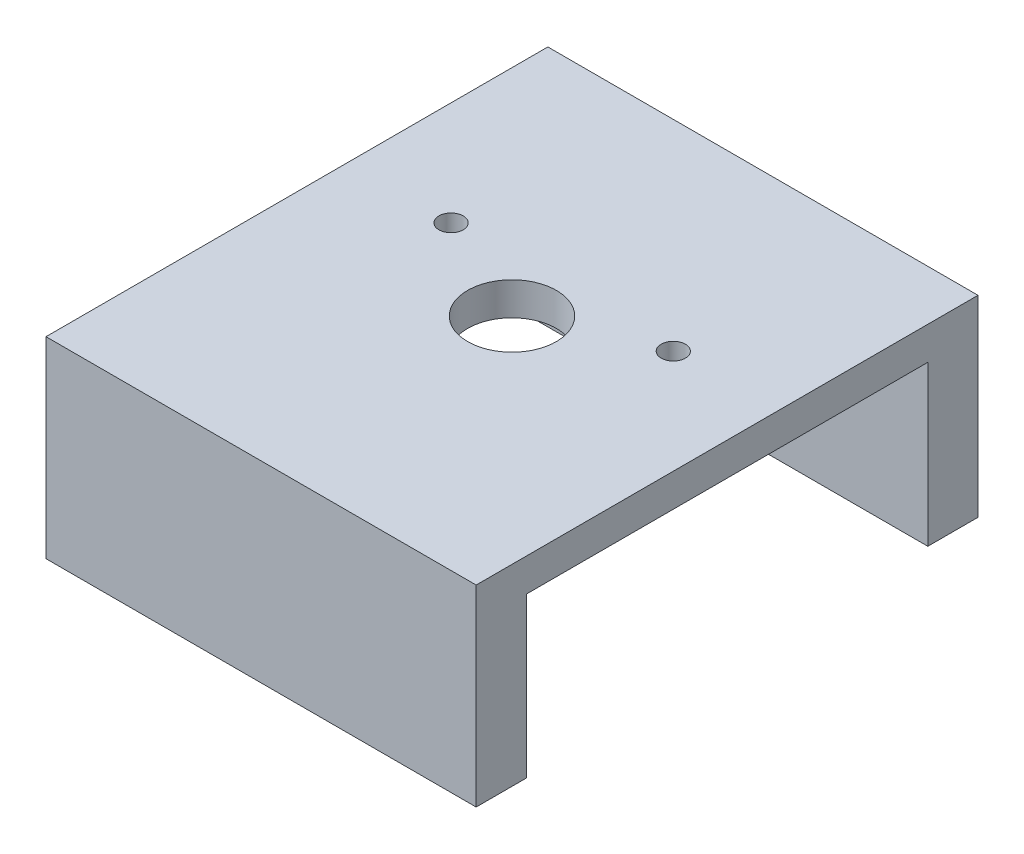
ISO-10303-21;
HEADER;
FILE_DESCRIPTION(('STEP AP214'),'2;1');
FILE_NAME('part.step','',(''),(''),'','','');
FILE_SCHEMA(('AUTOMOTIVE_DESIGN { 1 0 10303 214 1 1 1 1 }'));
ENDSEC;
DATA;
#1=APPLICATION_CONTEXT('core data for automotive mechanical design processes');
#2=APPLICATION_PROTOCOL_DEFINITION('international standard','automotive_design',2000,#1);
#3=PRODUCT_CONTEXT('',#1,'mechanical');
#4=PRODUCT('Part','Part','',(#3));
#5=PRODUCT_RELATED_PRODUCT_CATEGORY('part','',(#4));
#6=PRODUCT_DEFINITION_FORMATION('','',#4);
#7=PRODUCT_DEFINITION_CONTEXT('part definition',#1,'design');
#8=PRODUCT_DEFINITION('design','',#6,#7);
#9=PRODUCT_DEFINITION_SHAPE('','',#8);
#10=(LENGTH_UNIT() NAMED_UNIT(*) SI_UNIT(.MILLI.,.METRE.));
#11=(NAMED_UNIT(*) PLANE_ANGLE_UNIT() SI_UNIT($,.RADIAN.));
#12=(NAMED_UNIT(*) SI_UNIT($,.STERADIAN.) SOLID_ANGLE_UNIT());
#13=UNCERTAINTY_MEASURE_WITH_UNIT(LENGTH_MEASURE(1.E-05),#10,'distance_accuracy_value','');
#14=(GEOMETRIC_REPRESENTATION_CONTEXT(3) GLOBAL_UNCERTAINTY_ASSIGNED_CONTEXT((#13)) GLOBAL_UNIT_ASSIGNED_CONTEXT((#10,
#11,#12)) REPRESENTATION_CONTEXT('',''));
#15=CARTESIAN_POINT('',(0.,0.,0.));
#16=DIRECTION('',(0.,0.,1.));
#17=DIRECTION('',(1.,0.,0.));
#18=AXIS2_PLACEMENT_3D('',#15,#16,#17);
#19=CARTESIAN_POINT('',(0.,0.,0.));
#20=DIRECTION('',(0.,-1.,0.));
#21=DIRECTION('',(0.,0.,-1.));
#22=AXIS2_PLACEMENT_3D('',#19,#20,#21);
#23=PLANE('',#22);
#24=DIRECTION('',(1.,0.,0.));
#25=VECTOR('',#24,1.);
#26=CARTESIAN_POINT('',(60.,0.,-7.));
#27=LINE('',#26,#25);
#28=CARTESIAN_POINT('',(0.,0.,-7.));
#29=VERTEX_POINT('',#28);
#30=CARTESIAN_POINT('',(60.,0.,-7.));
#31=VERTEX_POINT('',#30);
#32=EDGE_CURVE('E137',#29,#31,#27,.T.);
#33=ORIENTED_EDGE('',*,*,#32,.F.);
#34=DIRECTION('',(0.,0.,1.));
#35=VECTOR('',#34,1.);
#36=CARTESIAN_POINT('',(0.,0.,0.));
#37=LINE('',#36,#35);
#38=CARTESIAN_POINT('',(0.,0.,-63.));
#39=VERTEX_POINT('',#38);
#40=EDGE_CURVE('E178',#39,#29,#37,.T.);
#41=ORIENTED_EDGE('',*,*,#40,.F.);
#42=DIRECTION('',(1.,0.,0.));
#43=VECTOR('',#42,1.);
#44=CARTESIAN_POINT('',(60.,0.,-63.));
#45=LINE('',#44,#43);
#46=CARTESIAN_POINT('',(60.,0.,-63.));
#47=VERTEX_POINT('',#46);
#48=EDGE_CURVE('E173',#39,#47,#45,.T.);
#49=ORIENTED_EDGE('',*,*,#48,.T.);
#50=DIRECTION('',(0.,0.,-1.));
#51=VECTOR('',#50,1.);
#52=CARTESIAN_POINT('',(60.,0.,0.));
#53=LINE('',#52,#51);
#54=EDGE_CURVE('E41',#31,#47,#53,.T.);
#55=ORIENTED_EDGE('',*,*,#54,.F.);
#56=EDGE_LOOP('',(#33,#41,#49,#55));
#57=FACE_BOUND('',#56,.T.);
#58=CARTESIAN_POINT('',(30.,0.,-35.));
#59=DIRECTION('',(0.,1.,0.));
#60=DIRECTION('',(0.,0.,1.));
#61=AXIS2_PLACEMENT_3D('',#58,#59,#60);
#62=CIRCLE('',#61,6.19050000000001);
#63=CARTESIAN_POINT('',(30.,0.,-28.8095));
#64=VERTEX_POINT('',#63);
#65=EDGE_CURVE('E198',#64,#64,#62,.T.);
#66=ORIENTED_EDGE('',*,*,#65,.T.);
#67=EDGE_LOOP('',(#66));
#68=FACE_BOUND('',#67,.T.);
#69=CARTESIAN_POINT('',(45.5,0.,-42.));
#70=DIRECTION('',(0.,1.,0.));
#71=DIRECTION('',(0.,0.,1.));
#72=AXIS2_PLACEMENT_3D('',#69,#70,#71);
#73=CIRCLE('',#72,1.6905);
#74=CARTESIAN_POINT('',(45.5,0.,-40.3095));
#75=VERTEX_POINT('',#74);
#76=EDGE_CURVE('E205',#75,#75,#73,.T.);
#77=ORIENTED_EDGE('',*,*,#76,.T.);
#78=EDGE_LOOP('',(#77));
#79=FACE_BOUND('',#78,.T.);
#80=CARTESIAN_POINT('',(14.5,0.,-42.));
#81=DIRECTION('',(0.,1.,0.));
#82=DIRECTION('',(0.,0.,1.));
#83=AXIS2_PLACEMENT_3D('',#80,#81,#82);
#84=CIRCLE('',#83,1.6905);
#85=CARTESIAN_POINT('',(14.5,0.,-40.3095));
#86=VERTEX_POINT('',#85);
#87=EDGE_CURVE('E252',#86,#86,#84,.T.);
#88=ORIENTED_EDGE('',*,*,#87,.T.);
#89=EDGE_LOOP('',(#88));
#90=FACE_BOUND('',#89,.T.);
#91=ADVANCED_FACE('F37',(#57,#68,#79,#90),#23,.T.);
#92=CARTESIAN_POINT('',(0.,4.5974,0.));
#93=DIRECTION('',(1.,0.,0.));
#94=DIRECTION('',(0.,0.,-1.));
#95=AXIS2_PLACEMENT_3D('',#92,#93,#94);
#96=PLANE('',#95);
#97=DIRECTION('',(0.,-1.,0.));
#98=VECTOR('',#97,1.);
#99=CARTESIAN_POINT('',(0.,4.5974,-70.));
#100=LINE('',#99,#98);
#101=CARTESIAN_POINT('',(0.,4.5974,-70.));
#102=VERTEX_POINT('',#101);
#103=CARTESIAN_POINT('',(0.,-22.225,-70.));
#104=VERTEX_POINT('',#103);
#105=EDGE_CURVE('E218',#102,#104,#100,.T.);
#106=ORIENTED_EDGE('',*,*,#105,.T.);
#107=DIRECTION('',(0.,0.,-1.));
#108=VECTOR('',#107,1.);
#109=CARTESIAN_POINT('',(0.,-22.225,-63.));
#110=LINE('',#109,#108);
#111=CARTESIAN_POINT('',(0.,-22.225,-63.));
#112=VERTEX_POINT('',#111);
#113=EDGE_CURVE('E191',#112,#104,#110,.T.);
#114=ORIENTED_EDGE('',*,*,#113,.F.);
#115=DIRECTION('',(0.,1.,0.));
#116=VECTOR('',#115,1.);
#117=CARTESIAN_POINT('',(0.,0.,-63.));
#118=LINE('',#117,#116);
#119=EDGE_CURVE('E167',#112,#39,#118,.T.);
#120=ORIENTED_EDGE('',*,*,#119,.T.);
#121=ORIENTED_EDGE('',*,*,#40,.T.);
#122=DIRECTION('',(0.,1.,0.));
#123=VECTOR('',#122,1.);
#124=CARTESIAN_POINT('',(0.,0.,-7.));
#125=LINE('',#124,#123);
#126=CARTESIAN_POINT('',(0.,-22.225,-7.));
#127=VERTEX_POINT('',#126);
#128=EDGE_CURVE('E139',#127,#29,#125,.T.);
#129=ORIENTED_EDGE('',*,*,#128,.F.);
#130=DIRECTION('',(0.,0.,1.));
#131=VECTOR('',#130,1.);
#132=CARTESIAN_POINT('',(0.,-22.225,-7.));
#133=LINE('',#132,#131);
#134=CARTESIAN_POINT('',(0.,-22.225,0.));
#135=VERTEX_POINT('',#134);
#136=EDGE_CURVE('E143',#127,#135,#133,.T.);
#137=ORIENTED_EDGE('',*,*,#136,.T.);
#138=DIRECTION('',(0.,-1.,0.));
#139=VECTOR('',#138,1.);
#140=CARTESIAN_POINT('',(0.,4.5974,0.));
#141=LINE('',#140,#139);
#142=CARTESIAN_POINT('',(0.,4.5974,0.));
#143=VERTEX_POINT('',#142);
#144=EDGE_CURVE('E11',#143,#135,#141,.T.);
#145=ORIENTED_EDGE('',*,*,#144,.F.);
#146=DIRECTION('',(0.,0.,1.));
#147=VECTOR('',#146,1.);
#148=CARTESIAN_POINT('',(0.,4.5974,0.));
#149=LINE('',#148,#147);
#150=EDGE_CURVE('E199',#102,#143,#149,.T.);
#151=ORIENTED_EDGE('',*,*,#150,.F.);
#152=EDGE_LOOP('',(#106,#114,#120,#121,#129,#137,#145,#151));
#153=FACE_BOUND('',#152,.T.);
#154=ADVANCED_FACE('F39',(#153),#96,.F.);
#155=CARTESIAN_POINT('',(0.,4.5974,0.));
#156=DIRECTION('',(0.,0.,-1.));
#157=DIRECTION('',(-1.,0.,0.));
#158=AXIS2_PLACEMENT_3D('',#155,#156,#157);
#159=PLANE('',#158);
#160=ORIENTED_EDGE('',*,*,#144,.T.);
#161=DIRECTION('',(-1.,0.,0.));
#162=VECTOR('',#161,1.);
#163=CARTESIAN_POINT('',(0.,-22.225,0.));
#164=LINE('',#163,#162);
#165=CARTESIAN_POINT('',(60.,-22.225,0.));
#166=VERTEX_POINT('',#165);
#167=EDGE_CURVE('E135',#166,#135,#164,.T.);
#168=ORIENTED_EDGE('',*,*,#167,.F.);
#169=DIRECTION('',(0.,-1.,0.));
#170=VECTOR('',#169,1.);
#171=CARTESIAN_POINT('',(60.,4.5974,0.));
#172=LINE('',#171,#170);
#173=CARTESIAN_POINT('',(60.,4.5974,0.));
#174=VERTEX_POINT('',#173);
#175=EDGE_CURVE('E47',#174,#166,#172,.T.);
#176=ORIENTED_EDGE('',*,*,#175,.F.);
#177=DIRECTION('',(1.,0.,0.));
#178=VECTOR('',#177,1.);
#179=CARTESIAN_POINT('',(0.,4.5974,0.));
#180=LINE('',#179,#178);
#181=EDGE_CURVE('E213',#143,#174,#180,.T.);
#182=ORIENTED_EDGE('',*,*,#181,.F.);
#183=EDGE_LOOP('',(#160,#168,#176,#182));
#184=FACE_BOUND('',#183,.T.);
#185=ADVANCED_FACE('F231',(#184),#159,.F.);
#186=CARTESIAN_POINT('',(60.,4.5974,0.));
#187=DIRECTION('',(-1.,0.,0.));
#188=DIRECTION('',(0.,0.,1.));
#189=AXIS2_PLACEMENT_3D('',#186,#187,#188);
#190=PLANE('',#189);
#191=ORIENTED_EDGE('',*,*,#175,.T.);
#192=DIRECTION('',(0.,0.,1.));
#193=VECTOR('',#192,1.);
#194=CARTESIAN_POINT('',(60.,-22.225,-7.));
#195=LINE('',#194,#193);
#196=CARTESIAN_POINT('',(60.,-22.225,-7.));
#197=VERTEX_POINT('',#196);
#198=EDGE_CURVE('E146',#197,#166,#195,.T.);
#199=ORIENTED_EDGE('',*,*,#198,.F.);
#200=DIRECTION('',(0.,-1.,0.));
#201=VECTOR('',#200,1.);
#202=CARTESIAN_POINT('',(60.,-22.225,-7.));
#203=LINE('',#202,#201);
#204=EDGE_CURVE('E55',#31,#197,#203,.T.);
#205=ORIENTED_EDGE('',*,*,#204,.F.);
#206=ORIENTED_EDGE('',*,*,#54,.T.);
#207=DIRECTION('',(0.,-1.,0.));
#208=VECTOR('',#207,1.);
#209=CARTESIAN_POINT('',(60.,-22.225,-63.));
#210=LINE('',#209,#208);
#211=CARTESIAN_POINT('',(60.,-22.225,-63.));
#212=VERTEX_POINT('',#211);
#213=EDGE_CURVE('E168',#47,#212,#210,.T.);
#214=ORIENTED_EDGE('',*,*,#213,.T.);
#215=DIRECTION('',(0.,0.,-1.));
#216=VECTOR('',#215,1.);
#217=CARTESIAN_POINT('',(60.,-22.225,-63.));
#218=LINE('',#217,#216);
#219=CARTESIAN_POINT('',(60.,-22.225,-70.));
#220=VERTEX_POINT('',#219);
#221=EDGE_CURVE('E177',#212,#220,#218,.T.);
#222=ORIENTED_EDGE('',*,*,#221,.T.);
#223=DIRECTION('',(0.,-1.,0.));
#224=VECTOR('',#223,1.);
#225=CARTESIAN_POINT('',(60.,4.5974,-70.));
#226=LINE('',#225,#224);
#227=CARTESIAN_POINT('',(60.,4.5974,-70.));
#228=VERTEX_POINT('',#227);
#229=EDGE_CURVE('E223',#228,#220,#226,.T.);
#230=ORIENTED_EDGE('',*,*,#229,.F.);
#231=DIRECTION('',(0.,0.,-1.));
#232=VECTOR('',#231,1.);
#233=CARTESIAN_POINT('',(60.,4.5974,0.));
#234=LINE('',#233,#232);
#235=EDGE_CURVE('E215',#174,#228,#234,.T.);
#236=ORIENTED_EDGE('',*,*,#235,.F.);
#237=EDGE_LOOP('',(#191,#199,#205,#206,#214,#222,#230,#236));
#238=FACE_BOUND('',#237,.T.);
#239=ADVANCED_FACE('F228',(#238),#190,.F.);
#240=CARTESIAN_POINT('',(0.,4.5974,-70.));
#241=DIRECTION('',(0.,0.,1.));
#242=DIRECTION('',(1.,0.,0.));
#243=AXIS2_PLACEMENT_3D('',#240,#241,#242);
#244=PLANE('',#243);
#245=ORIENTED_EDGE('',*,*,#229,.T.);
#246=DIRECTION('',(-1.,0.,0.));
#247=VECTOR('',#246,1.);
#248=CARTESIAN_POINT('',(0.,-22.225,-70.));
#249=LINE('',#248,#247);
#250=EDGE_CURVE('E163',#220,#104,#249,.T.);
#251=ORIENTED_EDGE('',*,*,#250,.T.);
#252=ORIENTED_EDGE('',*,*,#105,.F.);
#253=DIRECTION('',(-1.,0.,0.));
#254=VECTOR('',#253,1.);
#255=CARTESIAN_POINT('',(0.,4.5974,-70.));
#256=LINE('',#255,#254);
#257=EDGE_CURVE('E217',#228,#102,#256,.T.);
#258=ORIENTED_EDGE('',*,*,#257,.F.);
#259=EDGE_LOOP('',(#245,#251,#252,#258));
#260=FACE_BOUND('',#259,.T.);
#261=ADVANCED_FACE('F245',(#260),#244,.F.);
#262=CARTESIAN_POINT('',(0.,4.5974,0.));
#263=DIRECTION('',(0.,-1.,0.));
#264=DIRECTION('',(0.,0.,-1.));
#265=AXIS2_PLACEMENT_3D('',#262,#263,#264);
#266=PLANE('',#265);
#267=CARTESIAN_POINT('',(14.5,4.5974,-42.));
#268=DIRECTION('',(0.,1.,0.));
#269=DIRECTION('',(0.,0.,1.));
#270=AXIS2_PLACEMENT_3D('',#267,#268,#269);
#271=CIRCLE('',#270,1.6905);
#272=CARTESIAN_POINT('',(14.5,4.5974,-40.3095));
#273=VERTEX_POINT('',#272);
#274=EDGE_CURVE('E250',#273,#273,#271,.T.);
#275=ORIENTED_EDGE('',*,*,#274,.F.);
#276=EDGE_LOOP('',(#275));
#277=FACE_BOUND('',#276,.T.);
#278=CARTESIAN_POINT('',(45.5,4.5974,-42.));
#279=DIRECTION('',(0.,1.,0.));
#280=DIRECTION('',(0.,0.,1.));
#281=AXIS2_PLACEMENT_3D('',#278,#279,#280);
#282=CIRCLE('',#281,1.6905);
#283=CARTESIAN_POINT('',(45.5,4.5974,-40.3095));
#284=VERTEX_POINT('',#283);
#285=EDGE_CURVE('E208',#284,#284,#282,.T.);
#286=ORIENTED_EDGE('',*,*,#285,.F.);
#287=EDGE_LOOP('',(#286));
#288=FACE_BOUND('',#287,.T.);
#289=CARTESIAN_POINT('',(30.,4.5974,-35.));
#290=DIRECTION('',(0.,1.,0.));
#291=DIRECTION('',(0.,0.,1.));
#292=AXIS2_PLACEMENT_3D('',#289,#290,#291);
#293=CIRCLE('',#292,6.19050000000001);
#294=CARTESIAN_POINT('',(30.,4.5974,-28.8095));
#295=VERTEX_POINT('',#294);
#296=EDGE_CURVE('E201',#295,#295,#293,.T.);
#297=ORIENTED_EDGE('',*,*,#296,.F.);
#298=EDGE_LOOP('',(#297));
#299=FACE_BOUND('',#298,.T.);
#300=ORIENTED_EDGE('',*,*,#150,.T.);
#301=ORIENTED_EDGE('',*,*,#181,.T.);
#302=ORIENTED_EDGE('',*,*,#235,.T.);
#303=ORIENTED_EDGE('',*,*,#257,.T.);
#304=EDGE_LOOP('',(#300,#301,#302,#303));
#305=FACE_BOUND('',#304,.T.);
#306=ADVANCED_FACE('F241',(#277,#288,#299,#305),#266,.F.);
#307=CARTESIAN_POINT('',(30.,0.,-35.));
#308=DIRECTION('',(0.,1.,0.));
#309=DIRECTION('',(0.,0.,1.));
#310=AXIS2_PLACEMENT_3D('',#307,#308,#309);
#311=CYLINDRICAL_SURFACE('',#310,6.19050000000001);
#312=ORIENTED_EDGE('',*,*,#65,.F.);
#313=EDGE_LOOP('',(#312));
#314=FACE_BOUND('',#313,.T.);
#315=ORIENTED_EDGE('',*,*,#296,.T.);
#316=EDGE_LOOP('',(#315));
#317=FACE_BOUND('',#316,.T.);
#318=ADVANCED_FACE('F267',(#314,#317),#311,.F.);
#319=CARTESIAN_POINT('',(45.5,0.,-42.));
#320=DIRECTION('',(0.,1.,0.));
#321=DIRECTION('',(0.,0.,1.));
#322=AXIS2_PLACEMENT_3D('',#319,#320,#321);
#323=CYLINDRICAL_SURFACE('',#322,1.6905);
#324=ORIENTED_EDGE('',*,*,#76,.F.);
#325=EDGE_LOOP('',(#324));
#326=FACE_BOUND('',#325,.T.);
#327=ORIENTED_EDGE('',*,*,#285,.T.);
#328=EDGE_LOOP('',(#327));
#329=FACE_BOUND('',#328,.T.);
#330=ADVANCED_FACE('F263',(#326,#329),#323,.F.);
#331=CARTESIAN_POINT('',(14.5,0.,-42.));
#332=DIRECTION('',(0.,1.,0.));
#333=DIRECTION('',(0.,0.,1.));
#334=AXIS2_PLACEMENT_3D('',#331,#332,#333);
#335=CYLINDRICAL_SURFACE('',#334,1.6905);
#336=ORIENTED_EDGE('',*,*,#87,.F.);
#337=EDGE_LOOP('',(#336));
#338=FACE_BOUND('',#337,.T.);
#339=ORIENTED_EDGE('',*,*,#274,.T.);
#340=EDGE_LOOP('',(#339));
#341=FACE_BOUND('',#340,.T.);
#342=ADVANCED_FACE('F278',(#338,#341),#335,.F.);
#343=CARTESIAN_POINT('',(0.,-22.225,-63.));
#344=DIRECTION('',(0.,-1.,0.));
#345=DIRECTION('',(0.,0.,-1.));
#346=AXIS2_PLACEMENT_3D('',#343,#344,#345);
#347=PLANE('',#346);
#348=CARTESIAN_POINT('',(6.35104386015332,-22.225,-66.3681092284144));
#349=DIRECTION('',(0.,-1.,0.));
#350=DIRECTION('',(0.,0.,-1.));
#351=AXIS2_PLACEMENT_3D('',#348,#349,#350);
#352=CIRCLE('',#351,1.35254999999999);
#353=CARTESIAN_POINT('',(6.35104386015332,-22.225,-67.7206592284144));
#354=VERTEX_POINT('',#353);
#355=EDGE_CURVE('E149',#354,#354,#352,.T.);
#356=ORIENTED_EDGE('',*,*,#355,.F.);
#357=EDGE_LOOP('',(#356));
#358=FACE_BOUND('',#357,.T.);
#359=CARTESIAN_POINT('',(53.65,-22.225,-66.3249191923123));
#360=DIRECTION('',(0.,-1.,0.));
#361=DIRECTION('',(0.,0.,-1.));
#362=AXIS2_PLACEMENT_3D('',#359,#360,#361);
#363=CIRCLE('',#362,1.35254999999999);
#364=CARTESIAN_POINT('',(53.65,-22.225,-67.6774691923123));
#365=VERTEX_POINT('',#364);
#366=EDGE_CURVE('E157',#365,#365,#363,.T.);
#367=ORIENTED_EDGE('',*,*,#366,.F.);
#368=EDGE_LOOP('',(#367));
#369=FACE_BOUND('',#368,.T.);
#370=ORIENTED_EDGE('',*,*,#250,.F.);
#371=ORIENTED_EDGE('',*,*,#221,.F.);
#372=DIRECTION('',(-1.,0.,0.));
#373=VECTOR('',#372,1.);
#374=CARTESIAN_POINT('',(0.,-22.225,-63.));
#375=LINE('',#374,#373);
#376=EDGE_CURVE('E164',#212,#112,#375,.T.);
#377=ORIENTED_EDGE('',*,*,#376,.T.);
#378=ORIENTED_EDGE('',*,*,#113,.T.);
#379=EDGE_LOOP('',(#370,#371,#377,#378));
#380=FACE_BOUND('',#379,.T.);
#381=ADVANCED_FACE('F249',(#358,#369,#380),#347,.T.);
#382=CARTESIAN_POINT('',(0.,0.,-63.));
#383=DIRECTION('',(0.,0.,1.));
#384=DIRECTION('',(1.,0.,0.));
#385=AXIS2_PLACEMENT_3D('',#382,#383,#384);
#386=PLANE('',#385);
#387=ORIENTED_EDGE('',*,*,#213,.F.);
#388=ORIENTED_EDGE('',*,*,#48,.F.);
#389=ORIENTED_EDGE('',*,*,#119,.F.);
#390=ORIENTED_EDGE('',*,*,#376,.F.);
#391=EDGE_LOOP('',(#387,#388,#389,#390));
#392=FACE_BOUND('',#391,.T.);
#393=ADVANCED_FACE('F194',(#392),#386,.T.);
#394=CARTESIAN_POINT('',(53.65,3.17499999999999,-66.3249191923123));
#395=DIRECTION('',(0.,-1.,0.));
#396=DIRECTION('',(0.,0.,-1.));
#397=AXIS2_PLACEMENT_3D('',#394,#395,#396);
#398=CONICAL_SURFACE('',#397,1.35254999999999,1.02974425867665);
#399=CARTESIAN_POINT('',(53.65,3.98769403026572,-66.3249191923123));
#400=VERTEX_POINT('',#399);
#401=VERTEX_LOOP('',#400);
#402=FACE_BOUND('',#401,.T.);
#403=CARTESIAN_POINT('',(53.65,3.17499999999999,-66.3249191923123));
#404=DIRECTION('',(0.,-1.,0.));
#405=DIRECTION('',(0.,0.,-1.));
#406=AXIS2_PLACEMENT_3D('',#403,#404,#405);
#407=CIRCLE('',#406,1.35254999999999);
#408=CARTESIAN_POINT('',(53.65,3.17499999999999,-67.6774691923123));
#409=VERTEX_POINT('',#408);
#410=EDGE_CURVE('E160',#409,#409,#407,.T.);
#411=ORIENTED_EDGE('',*,*,#410,.T.);
#412=EDGE_LOOP('',(#411));
#413=FACE_BOUND('',#412,.T.);
#414=ADVANCED_FACE('F345',(#402,#413),#398,.F.);
#415=CARTESIAN_POINT('',(53.65,-22.225,-66.3249191923123));
#416=DIRECTION('',(0.,-1.,0.));
#417=DIRECTION('',(0.,0.,-1.));
#418=AXIS2_PLACEMENT_3D('',#415,#416,#417);
#419=CYLINDRICAL_SURFACE('',#418,1.35254999999999);
#420=ORIENTED_EDGE('',*,*,#410,.F.);
#421=EDGE_LOOP('',(#420));
#422=FACE_BOUND('',#421,.T.);
#423=ORIENTED_EDGE('',*,*,#366,.T.);
#424=EDGE_LOOP('',(#423));
#425=FACE_BOUND('',#424,.T.);
#426=ADVANCED_FACE('F351',(#422,#425),#419,.F.);
#427=CARTESIAN_POINT('',(6.35104386015332,3.175,-66.3681092284144));
#428=DIRECTION('',(0.,-1.,0.));
#429=DIRECTION('',(0.,0.,-1.));
#430=AXIS2_PLACEMENT_3D('',#427,#428,#429);
#431=CONICAL_SURFACE('',#430,1.35255,1.02974425867665);
#432=CARTESIAN_POINT('',(6.35104386015332,3.98769403026573,-66.3681092284144));
#433=VERTEX_POINT('',#432);
#434=VERTEX_LOOP('',#433);
#435=FACE_BOUND('',#434,.T.);
#436=CARTESIAN_POINT('',(6.35104386015332,3.175,-66.3681092284144));
#437=DIRECTION('',(0.,-1.,0.));
#438=DIRECTION('',(0.,0.,-1.));
#439=AXIS2_PLACEMENT_3D('',#436,#437,#438);
#440=CIRCLE('',#439,1.35255);
#441=CARTESIAN_POINT('',(6.35104386015332,3.175,-67.7206592284144));
#442=VERTEX_POINT('',#441);
#443=EDGE_CURVE('E154',#442,#442,#440,.T.);
#444=ORIENTED_EDGE('',*,*,#443,.T.);
#445=EDGE_LOOP('',(#444));
#446=FACE_BOUND('',#445,.T.);
#447=ADVANCED_FACE('F359',(#435,#446),#431,.F.);
#448=CARTESIAN_POINT('',(6.35104386015332,-22.225,-66.3681092284144));
#449=DIRECTION('',(0.,-1.,0.));
#450=DIRECTION('',(0.,0.,-1.));
#451=AXIS2_PLACEMENT_3D('',#448,#449,#450);
#452=CYLINDRICAL_SURFACE('',#451,1.35254999999999);
#453=ORIENTED_EDGE('',*,*,#443,.F.);
#454=EDGE_LOOP('',(#453));
#455=FACE_BOUND('',#454,.T.);
#456=ORIENTED_EDGE('',*,*,#355,.T.);
#457=EDGE_LOOP('',(#456));
#458=FACE_BOUND('',#457,.T.);
#459=ADVANCED_FACE('F367',(#455,#458),#452,.F.);
#460=CARTESIAN_POINT('',(0.,-22.225,-7.));
#461=DIRECTION('',(0.,1.,0.));
#462=DIRECTION('',(0.,0.,1.));
#463=AXIS2_PLACEMENT_3D('',#460,#461,#462);
#464=PLANE('',#463);
#465=CARTESIAN_POINT('',(6.35104386015332,-22.225,-3.63189077158563));
#466=DIRECTION('',(0.,-1.,0.));
#467=DIRECTION('',(0.,0.,-1.));
#468=AXIS2_PLACEMENT_3D('',#465,#466,#467);
#469=CIRCLE('',#468,1.35254999999999);
#470=CARTESIAN_POINT('',(6.35104386015332,-22.225,-4.98444077158562));
#471=VERTEX_POINT('',#470);
#472=EDGE_CURVE('E125',#471,#471,#469,.T.);
#473=ORIENTED_EDGE('',*,*,#472,.F.);
#474=EDGE_LOOP('',(#473));
#475=FACE_BOUND('',#474,.T.);
#476=CARTESIAN_POINT('',(53.65,-22.225,-3.67508080768769));
#477=DIRECTION('',(0.,-1.,0.));
#478=DIRECTION('',(0.,0.,-1.));
#479=AXIS2_PLACEMENT_3D('',#476,#477,#478);
#480=CIRCLE('',#479,1.35254999999999);
#481=CARTESIAN_POINT('',(53.65,-22.225,-5.02763080768768));
#482=VERTEX_POINT('',#481);
#483=EDGE_CURVE('E124',#482,#482,#480,.T.);
#484=ORIENTED_EDGE('',*,*,#483,.F.);
#485=EDGE_LOOP('',(#484));
#486=FACE_BOUND('',#485,.T.);
#487=ORIENTED_EDGE('',*,*,#167,.T.);
#488=ORIENTED_EDGE('',*,*,#136,.F.);
#489=DIRECTION('',(-1.,0.,0.));
#490=VECTOR('',#489,1.);
#491=CARTESIAN_POINT('',(0.,-22.225,-7.));
#492=LINE('',#491,#490);
#493=EDGE_CURVE('E141',#197,#127,#492,.T.);
#494=ORIENTED_EDGE('',*,*,#493,.F.);
#495=ORIENTED_EDGE('',*,*,#198,.T.);
#496=EDGE_LOOP('',(#487,#488,#494,#495));
#497=FACE_BOUND('',#496,.T.);
#498=ADVANCED_FACE('F235',(#475,#486,#497),#464,.F.);
#499=CARTESIAN_POINT('',(0.,0.,-7.));
#500=DIRECTION('',(0.,0.,-1.));
#501=DIRECTION('',(1.,0.,0.));
#502=AXIS2_PLACEMENT_3D('',#499,#500,#501);
#503=PLANE('',#502);
#504=ORIENTED_EDGE('',*,*,#204,.T.);
#505=ORIENTED_EDGE('',*,*,#493,.T.);
#506=ORIENTED_EDGE('',*,*,#128,.T.);
#507=ORIENTED_EDGE('',*,*,#32,.T.);
#508=EDGE_LOOP('',(#504,#505,#506,#507));
#509=FACE_BOUND('',#508,.T.);
#510=ADVANCED_FACE('F237',(#509),#503,.T.);
#511=CARTESIAN_POINT('',(53.65,3.17499999999999,-3.67508080768769));
#512=DIRECTION('',(0.,-1.,0.));
#513=DIRECTION('',(0.,0.,-1.));
#514=AXIS2_PLACEMENT_3D('',#511,#512,#513);
#515=CONICAL_SURFACE('',#514,1.35254999999999,1.02974425867665);
#516=CARTESIAN_POINT('',(53.65,3.98769403026572,-3.67508080768769));
#517=VERTEX_POINT('',#516);
#518=VERTEX_LOOP('',#517);
#519=FACE_BOUND('',#518,.T.);
#520=CARTESIAN_POINT('',(53.65,3.17499999999999,-3.67508080768769));
#521=DIRECTION('',(0.,-1.,0.));
#522=DIRECTION('',(0.,0.,-1.));
#523=AXIS2_PLACEMENT_3D('',#520,#521,#522);
#524=CIRCLE('',#523,1.35254999999999);
#525=CARTESIAN_POINT('',(53.65,3.17499999999999,-5.02763080768769));
#526=VERTEX_POINT('',#525);
#527=EDGE_CURVE('E128',#526,#526,#524,.T.);
#528=ORIENTED_EDGE('',*,*,#527,.T.);
#529=EDGE_LOOP('',(#528));
#530=FACE_BOUND('',#529,.T.);
#531=ADVANCED_FACE('F388',(#519,#530),#515,.F.);
#532=CARTESIAN_POINT('',(53.65,-22.225,-3.67508080768769));
#533=DIRECTION('',(0.,-1.,0.));
#534=DIRECTION('',(0.,0.,-1.));
#535=AXIS2_PLACEMENT_3D('',#532,#533,#534);
#536=CYLINDRICAL_SURFACE('',#535,1.35254999999999);
#537=ORIENTED_EDGE('',*,*,#527,.F.);
#538=EDGE_LOOP('',(#537));
#539=FACE_BOUND('',#538,.T.);
#540=ORIENTED_EDGE('',*,*,#483,.T.);
#541=EDGE_LOOP('',(#540));
#542=FACE_BOUND('',#541,.T.);
#543=ADVANCED_FACE('F118',(#539,#542),#536,.F.);
#544=CARTESIAN_POINT('',(6.35104386015332,3.175,-3.63189077158563));
#545=DIRECTION('',(0.,-1.,0.));
#546=DIRECTION('',(0.,0.,-1.));
#547=AXIS2_PLACEMENT_3D('',#544,#545,#546);
#548=CONICAL_SURFACE('',#547,1.35255,1.02974425867665);
#549=CARTESIAN_POINT('',(6.35104386015332,3.98769403026573,-3.63189077158563));
#550=VERTEX_POINT('',#549);
#551=VERTEX_LOOP('',#550);
#552=FACE_BOUND('',#551,.T.);
#553=CARTESIAN_POINT('',(6.35104386015332,3.175,-3.63189077158563));
#554=DIRECTION('',(0.,-1.,0.));
#555=DIRECTION('',(0.,0.,-1.));
#556=AXIS2_PLACEMENT_3D('',#553,#554,#555);
#557=CIRCLE('',#556,1.35255);
#558=CARTESIAN_POINT('',(6.35104386015332,3.175,-4.98444077158562));
#559=VERTEX_POINT('',#558);
#560=EDGE_CURVE('E122',#559,#559,#557,.T.);
#561=ORIENTED_EDGE('',*,*,#560,.T.);
#562=EDGE_LOOP('',(#561));
#563=FACE_BOUND('',#562,.T.);
#564=ADVANCED_FACE('F114',(#552,#563),#548,.F.);
#565=CARTESIAN_POINT('',(6.35104386015332,-22.225,-3.63189077158563));
#566=DIRECTION('',(0.,-1.,0.));
#567=DIRECTION('',(0.,0.,-1.));
#568=AXIS2_PLACEMENT_3D('',#565,#566,#567);
#569=CYLINDRICAL_SURFACE('',#568,1.35254999999999);
#570=ORIENTED_EDGE('',*,*,#560,.F.);
#571=EDGE_LOOP('',(#570));
#572=FACE_BOUND('',#571,.T.);
#573=ORIENTED_EDGE('',*,*,#472,.T.);
#574=EDGE_LOOP('',(#573));
#575=FACE_BOUND('',#574,.T.);
#576=ADVANCED_FACE('F117',(#572,#575),#569,.F.);
#577=CLOSED_SHELL('',(#91,#154,#185,#239,#261,#306,#318,#330,#342,#381,#393,#414,#426,#447,#459,
#498,#510,#531,#543,#564,#576));
#578=MANIFOLD_SOLID_BREP('B2',#577);
#579=ADVANCED_BREP_SHAPE_REPRESENTATION('',(#18,#578),#14);
#580=SHAPE_DEFINITION_REPRESENTATION(#9,#579);
ENDSEC;
END-ISO-10303-21;
